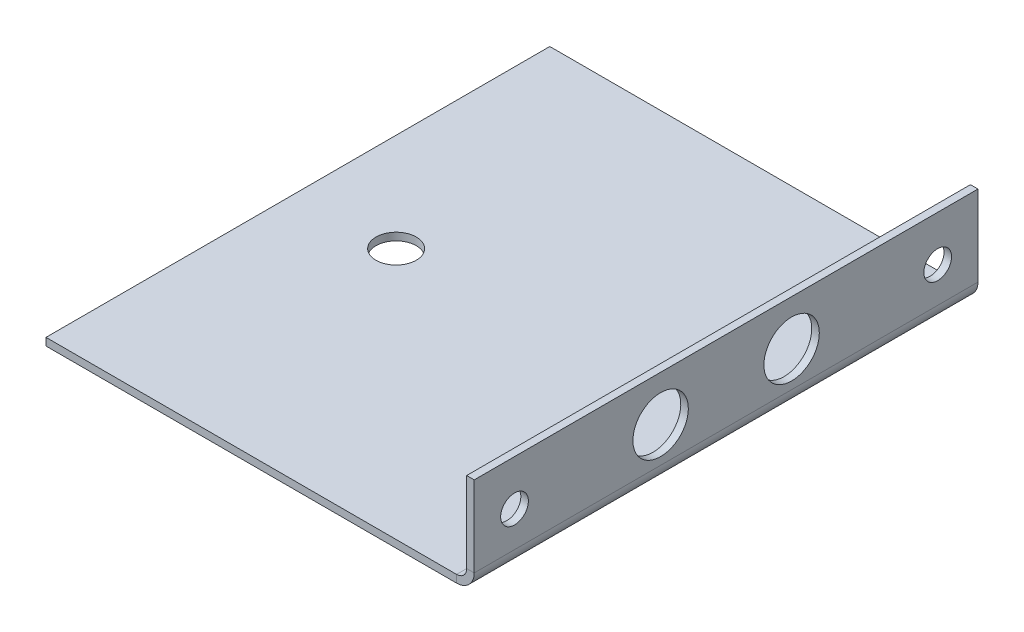
ISO-10303-21;
HEADER;
FILE_DESCRIPTION(('STEP AP214'),'2;1');
FILE_NAME('part.step','',(''),(''),'','','');
FILE_SCHEMA(('AUTOMOTIVE_DESIGN { 1 0 10303 214 1 1 1 1 }'));
ENDSEC;
DATA;
#1=APPLICATION_CONTEXT('core data for automotive mechanical design processes');
#2=APPLICATION_PROTOCOL_DEFINITION('international standard','automotive_design',2000,#1);
#3=PRODUCT_CONTEXT('',#1,'mechanical');
#4=PRODUCT('Part','Part','',(#3));
#5=PRODUCT_RELATED_PRODUCT_CATEGORY('part','',(#4));
#6=PRODUCT_DEFINITION_FORMATION('','',#4);
#7=PRODUCT_DEFINITION_CONTEXT('part definition',#1,'design');
#8=PRODUCT_DEFINITION('design','',#6,#7);
#9=PRODUCT_DEFINITION_SHAPE('','',#8);
#10=(LENGTH_UNIT() NAMED_UNIT(*) SI_UNIT(.MILLI.,.METRE.));
#11=(NAMED_UNIT(*) PLANE_ANGLE_UNIT() SI_UNIT($,.RADIAN.));
#12=(NAMED_UNIT(*) SI_UNIT($,.STERADIAN.) SOLID_ANGLE_UNIT());
#13=UNCERTAINTY_MEASURE_WITH_UNIT(LENGTH_MEASURE(1.E-05),#10,'distance_accuracy_value','');
#14=(GEOMETRIC_REPRESENTATION_CONTEXT(3) GLOBAL_UNCERTAINTY_ASSIGNED_CONTEXT((#13)) GLOBAL_UNIT_ASSIGNED_CONTEXT((#10,
#11,#12)) REPRESENTATION_CONTEXT('',''));
#15=CARTESIAN_POINT('',(0.,0.,0.));
#16=DIRECTION('',(0.,0.,1.));
#17=DIRECTION('',(1.,0.,0.));
#18=AXIS2_PLACEMENT_3D('',#15,#16,#17);
#19=CARTESIAN_POINT('',(-3.5,0.,100.));
#20=DIRECTION('',(0.,0.,1.));
#21=DIRECTION('',(1.,0.,0.));
#22=AXIS2_PLACEMENT_3D('',#19,#20,#21);
#23=PLANE('',#22);
#24=DIRECTION('',(0.,1.,0.));
#25=VECTOR('',#24,1.);
#26=CARTESIAN_POINT('',(-3.5,0.,100.));
#27=LINE('',#26,#25);
#28=CARTESIAN_POINT('',(-3.5,0.,100.));
#29=VERTEX_POINT('',#28);
#30=CARTESIAN_POINT('',(-3.5,1.5,100.));
#31=VERTEX_POINT('',#30);
#32=EDGE_CURVE('E11',#29,#31,#27,.T.);
#33=ORIENTED_EDGE('',*,*,#32,.F.);
#34=CARTESIAN_POINT('',(-3.5,3.5,100.));
#35=DIRECTION('',(0.,0.,1.));
#36=DIRECTION('',(1.,0.,0.));
#37=AXIS2_PLACEMENT_3D('',#34,#35,#36);
#38=CIRCLE('',#37,3.5);
#39=CARTESIAN_POINT('',(0.,3.5,100.));
#40=VERTEX_POINT('',#39);
#41=EDGE_CURVE('E136',#40,#29,#38,.F.);
#42=ORIENTED_EDGE('',*,*,#41,.F.);
#43=DIRECTION('',(1.,0.,0.));
#44=VECTOR('',#43,1.);
#45=CARTESIAN_POINT('',(-1.5,3.5,100.));
#46=LINE('',#45,#44);
#47=CARTESIAN_POINT('',(-1.5,3.5,100.));
#48=VERTEX_POINT('',#47);
#49=EDGE_CURVE('E47',#48,#40,#46,.T.);
#50=ORIENTED_EDGE('',*,*,#49,.F.);
#51=CARTESIAN_POINT('',(-3.5,3.5,100.));
#52=DIRECTION('',(0.,0.,1.));
#53=DIRECTION('',(1.,0.,0.));
#54=AXIS2_PLACEMENT_3D('',#51,#52,#53);
#55=CIRCLE('',#54,2.);
#56=EDGE_CURVE('E129',#48,#31,#55,.F.);
#57=ORIENTED_EDGE('',*,*,#56,.T.);
#58=EDGE_LOOP('',(#33,#42,#50,#57));
#59=FACE_BOUND('',#58,.T.);
#60=ADVANCED_FACE('F38',(#59),#23,.T.);
#61=CARTESIAN_POINT('',(-1.5,3.5,100.));
#62=DIRECTION('',(0.,0.,1.));
#63=DIRECTION('',(1.,0.,0.));
#64=AXIS2_PLACEMENT_3D('',#61,#62,#63);
#65=PLANE('',#64);
#66=DIRECTION('',(-1.,0.,0.));
#67=VECTOR('',#66,1.);
#68=CARTESIAN_POINT('',(0.,0.,100.));
#69=LINE('',#68,#67);
#70=CARTESIAN_POINT('',(-85.,0.,100.));
#71=VERTEX_POINT('',#70);
#72=EDGE_CURVE('E187',#29,#71,#69,.T.);
#73=ORIENTED_EDGE('',*,*,#72,.F.);
#74=ORIENTED_EDGE('',*,*,#32,.T.);
#75=DIRECTION('',(-1.,0.,0.));
#76=VECTOR('',#75,1.);
#77=CARTESIAN_POINT('',(0.,1.5,100.));
#78=LINE('',#77,#76);
#79=CARTESIAN_POINT('',(-85.,1.49999999999999,100.));
#80=VERTEX_POINT('',#79);
#81=EDGE_CURVE('E95',#31,#80,#78,.T.);
#82=ORIENTED_EDGE('',*,*,#81,.T.);
#83=DIRECTION('',(0.,1.,0.));
#84=VECTOR('',#83,1.);
#85=CARTESIAN_POINT('',(-85.,0.,100.));
#86=LINE('',#85,#84);
#87=EDGE_CURVE('E435',#71,#80,#86,.T.);
#88=ORIENTED_EDGE('',*,*,#87,.F.);
#89=EDGE_LOOP('',(#73,#74,#82,#88));
#90=FACE_BOUND('',#89,.T.);
#91=ADVANCED_FACE('F195',(#90),#65,.T.);
#92=CARTESIAN_POINT('',(0.,3.5,0.));
#93=DIRECTION('',(0.,0.,-1.));
#94=DIRECTION('',(-1.,0.,0.));
#95=AXIS2_PLACEMENT_3D('',#92,#93,#94);
#96=PLANE('',#95);
#97=DIRECTION('',(-1.,0.,0.));
#98=VECTOR('',#97,1.);
#99=CARTESIAN_POINT('',(0.,3.5,0.));
#100=LINE('',#99,#98);
#101=CARTESIAN_POINT('',(0.,3.5,0.));
#102=VERTEX_POINT('',#101);
#103=CARTESIAN_POINT('',(-1.5,3.5,0.));
#104=VERTEX_POINT('',#103);
#105=EDGE_CURVE('E82',#102,#104,#100,.T.);
#106=ORIENTED_EDGE('',*,*,#105,.F.);
#107=CARTESIAN_POINT('',(-3.5,3.5,0.));
#108=DIRECTION('',(0.,0.,1.));
#109=DIRECTION('',(1.,0.,0.));
#110=AXIS2_PLACEMENT_3D('',#107,#108,#109);
#111=CIRCLE('',#110,3.5);
#112=CARTESIAN_POINT('',(-3.5,0.,0.));
#113=VERTEX_POINT('',#112);
#114=EDGE_CURVE('E152',#102,#113,#111,.F.);
#115=ORIENTED_EDGE('',*,*,#114,.T.);
#116=DIRECTION('',(0.,-1.,0.));
#117=VECTOR('',#116,1.);
#118=CARTESIAN_POINT('',(-3.5,1.5,0.));
#119=LINE('',#118,#117);
#120=CARTESIAN_POINT('',(-3.5,1.5,0.));
#121=VERTEX_POINT('',#120);
#122=EDGE_CURVE('E89',#121,#113,#119,.T.);
#123=ORIENTED_EDGE('',*,*,#122,.F.);
#124=CARTESIAN_POINT('',(-3.5,3.5,0.));
#125=DIRECTION('',(0.,0.,1.));
#126=DIRECTION('',(1.,0.,0.));
#127=AXIS2_PLACEMENT_3D('',#124,#125,#126);
#128=CIRCLE('',#127,2.);
#129=EDGE_CURVE('E159',#104,#121,#128,.F.);
#130=ORIENTED_EDGE('',*,*,#129,.F.);
#131=EDGE_LOOP('',(#106,#115,#123,#130));
#132=FACE_BOUND('',#131,.T.);
#133=ADVANCED_FACE('F193',(#132),#96,.T.);
#134=CARTESIAN_POINT('',(-3.5,1.5,0.));
#135=DIRECTION('',(0.,0.,-1.));
#136=DIRECTION('',(-1.,0.,0.));
#137=AXIS2_PLACEMENT_3D('',#134,#135,#136);
#138=PLANE('',#137);
#139=DIRECTION('',(0.,-1.,0.));
#140=VECTOR('',#139,1.);
#141=CARTESIAN_POINT('',(0.,19.5,0.));
#142=LINE('',#141,#140);
#143=CARTESIAN_POINT('',(0.,19.5,0.));
#144=VERTEX_POINT('',#143);
#145=EDGE_CURVE('E154',#144,#102,#142,.T.);
#146=ORIENTED_EDGE('',*,*,#145,.T.);
#147=ORIENTED_EDGE('',*,*,#105,.T.);
#148=DIRECTION('',(0.,-1.,0.));
#149=VECTOR('',#148,1.);
#150=CARTESIAN_POINT('',(-1.5,19.5,0.));
#151=LINE('',#150,#149);
#152=CARTESIAN_POINT('',(-1.5,19.5,0.));
#153=VERTEX_POINT('',#152);
#154=EDGE_CURVE('E157',#153,#104,#151,.T.);
#155=ORIENTED_EDGE('',*,*,#154,.F.);
#156=DIRECTION('',(1.,0.,0.));
#157=VECTOR('',#156,1.);
#158=CARTESIAN_POINT('',(-1.5,19.5,0.));
#159=LINE('',#158,#157);
#160=EDGE_CURVE('E117',#153,#144,#159,.T.);
#161=ORIENTED_EDGE('',*,*,#160,.T.);
#162=EDGE_LOOP('',(#146,#147,#155,#161));
#163=FACE_BOUND('',#162,.T.);
#164=ADVANCED_FACE('F189',(#163),#138,.T.);
#165=CARTESIAN_POINT('',(0.,1.5,100.));
#166=DIRECTION('',(0.,-1.,0.));
#167=DIRECTION('',(1.,0.,0.));
#168=AXIS2_PLACEMENT_3D('',#165,#166,#167);
#169=PLANE('',#168);
#170=CARTESIAN_POINT('',(-65.5,1.49999999999999,50.));
#171=DIRECTION('',(0.,1.,0.));
#172=DIRECTION('',(-1.,0.,0.));
#173=AXIS2_PLACEMENT_3D('',#170,#171,#172);
#174=CIRCLE('',#173,4.);
#175=CARTESIAN_POINT('',(-69.5,1.49999999999999,50.));
#176=VERTEX_POINT('',#175);
#177=EDGE_CURVE('E408',#176,#176,#174,.T.);
#178=ORIENTED_EDGE('',*,*,#177,.F.);
#179=EDGE_LOOP('',(#178));
#180=FACE_BOUND('',#179,.T.);
#181=DIRECTION('',(-1.,0.,0.));
#182=VECTOR('',#181,1.);
#183=CARTESIAN_POINT('',(0.,1.5,0.));
#184=LINE('',#183,#182);
#185=CARTESIAN_POINT('',(-85.,1.49999999999999,0.));
#186=VERTEX_POINT('',#185);
#187=EDGE_CURVE('E142',#121,#186,#184,.T.);
#188=ORIENTED_EDGE('',*,*,#187,.T.);
#189=DIRECTION('',(0.,0.,-1.));
#190=VECTOR('',#189,1.);
#191=CARTESIAN_POINT('',(-85.,1.49999999999999,100.));
#192=LINE('',#191,#190);
#193=EDGE_CURVE('E173',#80,#186,#192,.T.);
#194=ORIENTED_EDGE('',*,*,#193,.F.);
#195=ORIENTED_EDGE('',*,*,#81,.F.);
#196=DIRECTION('',(0.,0.,-1.));
#197=VECTOR('',#196,1.);
#198=CARTESIAN_POINT('',(-3.5,1.5,100.));
#199=LINE('',#198,#197);
#200=EDGE_CURVE('E141',#31,#121,#199,.T.);
#201=ORIENTED_EDGE('',*,*,#200,.T.);
#202=EDGE_LOOP('',(#188,#194,#195,#201));
#203=FACE_BOUND('',#202,.T.);
#204=ADVANCED_FACE('F201',(#180,#203),#169,.F.);
#205=CARTESIAN_POINT('',(-85.,0.,100.));
#206=DIRECTION('',(-1.,0.,0.));
#207=DIRECTION('',(0.,0.,1.));
#208=AXIS2_PLACEMENT_3D('',#205,#206,#207);
#209=PLANE('',#208);
#210=DIRECTION('',(0.,1.,0.));
#211=VECTOR('',#210,1.);
#212=CARTESIAN_POINT('',(-85.,0.,0.));
#213=LINE('',#212,#211);
#214=CARTESIAN_POINT('',(-85.,0.,0.));
#215=VERTEX_POINT('',#214);
#216=EDGE_CURVE('E145',#215,#186,#213,.T.);
#217=ORIENTED_EDGE('',*,*,#216,.F.);
#218=DIRECTION('',(0.,0.,-1.));
#219=VECTOR('',#218,1.);
#220=CARTESIAN_POINT('',(-85.,0.,100.));
#221=LINE('',#220,#219);
#222=EDGE_CURVE('E171',#71,#215,#221,.T.);
#223=ORIENTED_EDGE('',*,*,#222,.F.);
#224=ORIENTED_EDGE('',*,*,#87,.T.);
#225=ORIENTED_EDGE('',*,*,#193,.T.);
#226=EDGE_LOOP('',(#217,#223,#224,#225));
#227=FACE_BOUND('',#226,.T.);
#228=ADVANCED_FACE('F230',(#227),#209,.T.);
#229=CARTESIAN_POINT('',(0.,0.,100.));
#230=DIRECTION('',(0.,-1.,0.));
#231=DIRECTION('',(1.,0.,0.));
#232=AXIS2_PLACEMENT_3D('',#229,#230,#231);
#233=PLANE('',#232);
#234=CARTESIAN_POINT('',(-65.5,0.,50.));
#235=DIRECTION('',(0.,-1.,0.));
#236=DIRECTION('',(1.,0.,0.));
#237=AXIS2_PLACEMENT_3D('',#234,#235,#236);
#238=CIRCLE('',#237,4.);
#239=CARTESIAN_POINT('',(-61.5,0.,50.));
#240=VERTEX_POINT('',#239);
#241=EDGE_CURVE('E41',#240,#240,#238,.T.);
#242=ORIENTED_EDGE('',*,*,#241,.F.);
#243=EDGE_LOOP('',(#242));
#244=FACE_BOUND('',#243,.T.);
#245=DIRECTION('',(-1.,0.,0.));
#246=VECTOR('',#245,1.);
#247=CARTESIAN_POINT('',(0.,0.,0.));
#248=LINE('',#247,#246);
#249=EDGE_CURVE('E149',#113,#215,#248,.T.);
#250=ORIENTED_EDGE('',*,*,#249,.F.);
#251=DIRECTION('',(0.,0.,-1.));
#252=VECTOR('',#251,1.);
#253=CARTESIAN_POINT('',(-3.5,0.,100.));
#254=LINE('',#253,#252);
#255=EDGE_CURVE('E168',#29,#113,#254,.T.);
#256=ORIENTED_EDGE('',*,*,#255,.F.);
#257=ORIENTED_EDGE('',*,*,#72,.T.);
#258=ORIENTED_EDGE('',*,*,#222,.T.);
#259=EDGE_LOOP('',(#250,#256,#257,#258));
#260=FACE_BOUND('',#259,.T.);
#261=ADVANCED_FACE('F235',(#244,#260),#233,.T.);
#262=CARTESIAN_POINT('',(-3.5,3.5,100.));
#263=DIRECTION('',(0.,0.,-1.));
#264=DIRECTION('',(-1.,0.,0.));
#265=AXIS2_PLACEMENT_3D('',#262,#263,#264);
#266=CYLINDRICAL_SURFACE('',#265,3.5);
#267=ORIENTED_EDGE('',*,*,#114,.F.);
#268=DIRECTION('',(0.,0.,-1.));
#269=VECTOR('',#268,1.);
#270=CARTESIAN_POINT('',(0.,3.5,100.));
#271=LINE('',#270,#269);
#272=EDGE_CURVE('E165',#40,#102,#271,.T.);
#273=ORIENTED_EDGE('',*,*,#272,.F.);
#274=ORIENTED_EDGE('',*,*,#41,.T.);
#275=ORIENTED_EDGE('',*,*,#255,.T.);
#276=EDGE_LOOP('',(#267,#273,#274,#275));
#277=FACE_BOUND('',#276,.T.);
#278=ADVANCED_FACE('F183',(#277),#266,.T.);
#279=CARTESIAN_POINT('',(0.,19.5,100.));
#280=DIRECTION('',(1.,0.,0.));
#281=DIRECTION('',(0.,1.,0.));
#282=AXIS2_PLACEMENT_3D('',#279,#280,#281);
#283=PLANE('',#282);
#284=CARTESIAN_POINT('',(0.,10.5,8.));
#285=DIRECTION('',(1.,0.,0.));
#286=DIRECTION('',(0.,1.,0.));
#287=AXIS2_PLACEMENT_3D('',#284,#285,#286);
#288=CIRCLE('',#287,2.75);
#289=CARTESIAN_POINT('',(0.,13.25,8.));
#290=VERTEX_POINT('',#289);
#291=EDGE_CURVE('E146',#290,#290,#288,.T.);
#292=ORIENTED_EDGE('',*,*,#291,.F.);
#293=EDGE_LOOP('',(#292));
#294=FACE_BOUND('',#293,.T.);
#295=CARTESIAN_POINT('',(0.,10.5,92.));
#296=DIRECTION('',(1.,0.,0.));
#297=DIRECTION('',(0.,1.,0.));
#298=AXIS2_PLACEMENT_3D('',#295,#296,#297);
#299=CIRCLE('',#298,2.74999999999999);
#300=CARTESIAN_POINT('',(0.,13.25,92.));
#301=VERTEX_POINT('',#300);
#302=EDGE_CURVE('E429',#301,#301,#299,.T.);
#303=ORIENTED_EDGE('',*,*,#302,.F.);
#304=EDGE_LOOP('',(#303));
#305=FACE_BOUND('',#304,.T.);
#306=CARTESIAN_POINT('',(0.,10.5,63.));
#307=DIRECTION('',(1.,0.,0.));
#308=DIRECTION('',(0.,1.,0.));
#309=AXIS2_PLACEMENT_3D('',#306,#307,#308);
#310=CIRCLE('',#309,5.5);
#311=CARTESIAN_POINT('',(0.,16.,63.));
#312=VERTEX_POINT('',#311);
#313=EDGE_CURVE('E426',#312,#312,#310,.T.);
#314=ORIENTED_EDGE('',*,*,#313,.F.);
#315=EDGE_LOOP('',(#314));
#316=FACE_BOUND('',#315,.T.);
#317=CARTESIAN_POINT('',(0.,10.5,37.));
#318=DIRECTION('',(1.,0.,0.));
#319=DIRECTION('',(0.,1.,0.));
#320=AXIS2_PLACEMENT_3D('',#317,#318,#319);
#321=CIRCLE('',#320,5.5);
#322=CARTESIAN_POINT('',(0.,16.,37.));
#323=VERTEX_POINT('',#322);
#324=EDGE_CURVE('E423',#323,#323,#321,.T.);
#325=ORIENTED_EDGE('',*,*,#324,.F.);
#326=EDGE_LOOP('',(#325));
#327=FACE_BOUND('',#326,.T.);
#328=ORIENTED_EDGE('',*,*,#145,.F.);
#329=DIRECTION('',(0.,0.,-1.));
#330=VECTOR('',#329,1.);
#331=CARTESIAN_POINT('',(0.,19.5,100.));
#332=LINE('',#331,#330);
#333=CARTESIAN_POINT('',(0.,19.5,100.));
#334=VERTEX_POINT('',#333);
#335=EDGE_CURVE('E119',#334,#144,#332,.T.);
#336=ORIENTED_EDGE('',*,*,#335,.F.);
#337=DIRECTION('',(0.,-1.,0.));
#338=VECTOR('',#337,1.);
#339=CARTESIAN_POINT('',(0.,19.5,100.));
#340=LINE('',#339,#338);
#341=EDGE_CURVE('E134',#334,#40,#340,.T.);
#342=ORIENTED_EDGE('',*,*,#341,.T.);
#343=ORIENTED_EDGE('',*,*,#272,.T.);
#344=EDGE_LOOP('',(#328,#336,#342,#343));
#345=FACE_BOUND('',#344,.T.);
#346=ADVANCED_FACE('F188',(#294,#305,#316,#327,#345),#283,.T.);
#347=CARTESIAN_POINT('',(-1.5,19.5,100.));
#348=DIRECTION('',(0.,1.,0.));
#349=DIRECTION('',(0.,0.,1.));
#350=AXIS2_PLACEMENT_3D('',#347,#348,#349);
#351=PLANE('',#350);
#352=ORIENTED_EDGE('',*,*,#160,.F.);
#353=DIRECTION('',(0.,0.,-1.));
#354=VECTOR('',#353,1.);
#355=CARTESIAN_POINT('',(-1.5,19.5,100.));
#356=LINE('',#355,#354);
#357=CARTESIAN_POINT('',(-1.5,19.5,100.));
#358=VERTEX_POINT('',#357);
#359=EDGE_CURVE('E111',#358,#153,#356,.T.);
#360=ORIENTED_EDGE('',*,*,#359,.F.);
#361=DIRECTION('',(1.,0.,0.));
#362=VECTOR('',#361,1.);
#363=CARTESIAN_POINT('',(-1.5,19.5,100.));
#364=LINE('',#363,#362);
#365=EDGE_CURVE('E115',#358,#334,#364,.T.);
#366=ORIENTED_EDGE('',*,*,#365,.T.);
#367=ORIENTED_EDGE('',*,*,#335,.T.);
#368=EDGE_LOOP('',(#352,#360,#366,#367));
#369=FACE_BOUND('',#368,.T.);
#370=ADVANCED_FACE('F113',(#369),#351,.T.);
#371=CARTESIAN_POINT('',(-1.5,19.5,100.));
#372=DIRECTION('',(1.,0.,0.));
#373=DIRECTION('',(0.,1.,0.));
#374=AXIS2_PLACEMENT_3D('',#371,#372,#373);
#375=PLANE('',#374);
#376=CARTESIAN_POINT('',(-1.5,10.5,8.));
#377=DIRECTION('',(-1.,0.,0.));
#378=DIRECTION('',(0.,-1.,0.));
#379=AXIS2_PLACEMENT_3D('',#376,#377,#378);
#380=CIRCLE('',#379,2.75);
#381=CARTESIAN_POINT('',(-1.5,7.75000000000001,8.));
#382=VERTEX_POINT('',#381);
#383=EDGE_CURVE('E415',#382,#382,#380,.T.);
#384=ORIENTED_EDGE('',*,*,#383,.F.);
#385=EDGE_LOOP('',(#384));
#386=FACE_BOUND('',#385,.T.);
#387=CARTESIAN_POINT('',(-1.5,10.5,92.));
#388=DIRECTION('',(-1.,0.,0.));
#389=DIRECTION('',(0.,1.,0.));
#390=AXIS2_PLACEMENT_3D('',#387,#388,#389);
#391=CIRCLE('',#390,2.74999999999999);
#392=CARTESIAN_POINT('',(-1.5,13.25,92.));
#393=VERTEX_POINT('',#392);
#394=EDGE_CURVE('E414',#393,#393,#391,.T.);
#395=ORIENTED_EDGE('',*,*,#394,.F.);
#396=EDGE_LOOP('',(#395));
#397=FACE_BOUND('',#396,.T.);
#398=CARTESIAN_POINT('',(-1.5,10.5,63.));
#399=DIRECTION('',(-1.,0.,0.));
#400=DIRECTION('',(0.,1.,0.));
#401=AXIS2_PLACEMENT_3D('',#398,#399,#400);
#402=CIRCLE('',#401,5.5);
#403=CARTESIAN_POINT('',(-1.5,16.,63.));
#404=VERTEX_POINT('',#403);
#405=EDGE_CURVE('E410',#404,#404,#402,.T.);
#406=ORIENTED_EDGE('',*,*,#405,.F.);
#407=EDGE_LOOP('',(#406));
#408=FACE_BOUND('',#407,.T.);
#409=CARTESIAN_POINT('',(-1.5,10.5,37.));
#410=DIRECTION('',(-1.,0.,0.));
#411=DIRECTION('',(0.,-1.,0.));
#412=AXIS2_PLACEMENT_3D('',#409,#410,#411);
#413=CIRCLE('',#412,5.5);
#414=CARTESIAN_POINT('',(-1.5,5.00000000000001,37.));
#415=VERTEX_POINT('',#414);
#416=EDGE_CURVE('E418',#415,#415,#413,.T.);
#417=ORIENTED_EDGE('',*,*,#416,.F.);
#418=EDGE_LOOP('',(#417));
#419=FACE_BOUND('',#418,.T.);
#420=ORIENTED_EDGE('',*,*,#154,.T.);
#421=DIRECTION('',(0.,0.,-1.));
#422=VECTOR('',#421,1.);
#423=CARTESIAN_POINT('',(-1.5,3.5,100.));
#424=LINE('',#423,#422);
#425=EDGE_CURVE('E120',#48,#104,#424,.T.);
#426=ORIENTED_EDGE('',*,*,#425,.F.);
#427=DIRECTION('',(0.,-1.,0.));
#428=VECTOR('',#427,1.);
#429=CARTESIAN_POINT('',(-1.5,19.5,100.));
#430=LINE('',#429,#428);
#431=EDGE_CURVE('E124',#358,#48,#430,.T.);
#432=ORIENTED_EDGE('',*,*,#431,.F.);
#433=ORIENTED_EDGE('',*,*,#359,.T.);
#434=EDGE_LOOP('',(#420,#426,#432,#433));
#435=FACE_BOUND('',#434,.T.);
#436=ADVANCED_FACE('F125',(#386,#397,#408,#419,#435),#375,.F.);
#437=CARTESIAN_POINT('',(-3.5,3.5,100.));
#438=DIRECTION('',(0.,0.,-1.));
#439=DIRECTION('',(-1.,0.,0.));
#440=AXIS2_PLACEMENT_3D('',#437,#438,#439);
#441=CYLINDRICAL_SURFACE('',#440,2.);
#442=ORIENTED_EDGE('',*,*,#129,.T.);
#443=ORIENTED_EDGE('',*,*,#200,.F.);
#444=ORIENTED_EDGE('',*,*,#56,.F.);
#445=ORIENTED_EDGE('',*,*,#425,.T.);
#446=EDGE_LOOP('',(#442,#443,#444,#445));
#447=FACE_BOUND('',#446,.T.);
#448=ADVANCED_FACE('F191',(#447),#441,.F.);
#449=CARTESIAN_POINT('',(-3.5,3.5,100.));
#450=DIRECTION('',(0.,0.,1.));
#451=DIRECTION('',(1.,0.,0.));
#452=AXIS2_PLACEMENT_3D('',#449,#450,#451);
#453=PLANE('',#452);
#454=ORIENTED_EDGE('',*,*,#431,.T.);
#455=ORIENTED_EDGE('',*,*,#49,.T.);
#456=ORIENTED_EDGE('',*,*,#341,.F.);
#457=ORIENTED_EDGE('',*,*,#365,.F.);
#458=EDGE_LOOP('',(#454,#455,#456,#457));
#459=FACE_BOUND('',#458,.T.);
#460=ADVANCED_FACE('F132',(#459),#453,.T.);
#461=CARTESIAN_POINT('',(-3.5,3.5,0.));
#462=DIRECTION('',(0.,0.,1.));
#463=DIRECTION('',(1.,0.,0.));
#464=AXIS2_PLACEMENT_3D('',#461,#462,#463);
#465=PLANE('',#464);
#466=ORIENTED_EDGE('',*,*,#187,.F.);
#467=ORIENTED_EDGE('',*,*,#122,.T.);
#468=ORIENTED_EDGE('',*,*,#249,.T.);
#469=ORIENTED_EDGE('',*,*,#216,.T.);
#470=EDGE_LOOP('',(#466,#467,#468,#469));
#471=FACE_BOUND('',#470,.T.);
#472=ADVANCED_FACE('F279',(#471),#465,.F.);
#473=CARTESIAN_POINT('',(8.5,10.5,37.));
#474=DIRECTION('',(-1.,0.,0.));
#475=DIRECTION('',(0.,-1.,0.));
#476=AXIS2_PLACEMENT_3D('',#473,#474,#475);
#477=CYLINDRICAL_SURFACE('',#476,5.5);
#478=ORIENTED_EDGE('',*,*,#324,.T.);
#479=EDGE_LOOP('',(#478));
#480=FACE_BOUND('',#479,.T.);
#481=ORIENTED_EDGE('',*,*,#416,.T.);
#482=EDGE_LOOP('',(#481));
#483=FACE_BOUND('',#482,.T.);
#484=ADVANCED_FACE('F289',(#480,#483),#477,.F.);
#485=CARTESIAN_POINT('',(8.5,10.5,63.));
#486=DIRECTION('',(-1.,0.,0.));
#487=DIRECTION('',(0.,-1.,0.));
#488=AXIS2_PLACEMENT_3D('',#485,#486,#487);
#489=CYLINDRICAL_SURFACE('',#488,5.5);
#490=ORIENTED_EDGE('',*,*,#313,.T.);
#491=EDGE_LOOP('',(#490));
#492=FACE_BOUND('',#491,.T.);
#493=ORIENTED_EDGE('',*,*,#405,.T.);
#494=EDGE_LOOP('',(#493));
#495=FACE_BOUND('',#494,.T.);
#496=ADVANCED_FACE('F316',(#492,#495),#489,.F.);
#497=CARTESIAN_POINT('',(8.5,10.5,92.));
#498=DIRECTION('',(-1.,0.,0.));
#499=DIRECTION('',(0.,-1.,0.));
#500=AXIS2_PLACEMENT_3D('',#497,#498,#499);
#501=CYLINDRICAL_SURFACE('',#500,2.74999999999999);
#502=ORIENTED_EDGE('',*,*,#302,.T.);
#503=EDGE_LOOP('',(#502));
#504=FACE_BOUND('',#503,.T.);
#505=ORIENTED_EDGE('',*,*,#394,.T.);
#506=EDGE_LOOP('',(#505));
#507=FACE_BOUND('',#506,.T.);
#508=ADVANCED_FACE('F327',(#504,#507),#501,.F.);
#509=CARTESIAN_POINT('',(8.5,10.5,8.));
#510=DIRECTION('',(-1.,0.,0.));
#511=DIRECTION('',(0.,-1.,0.));
#512=AXIS2_PLACEMENT_3D('',#509,#510,#511);
#513=CYLINDRICAL_SURFACE('',#512,2.75);
#514=ORIENTED_EDGE('',*,*,#291,.T.);
#515=EDGE_LOOP('',(#514));
#516=FACE_BOUND('',#515,.T.);
#517=ORIENTED_EDGE('',*,*,#383,.T.);
#518=EDGE_LOOP('',(#517));
#519=FACE_BOUND('',#518,.T.);
#520=ADVANCED_FACE('F338',(#516,#519),#513,.F.);
#521=CARTESIAN_POINT('',(-65.5,-8.50000000000001,50.));
#522=DIRECTION('',(0.,1.,0.));
#523=DIRECTION('',(-1.,0.,0.));
#524=AXIS2_PLACEMENT_3D('',#521,#522,#523);
#525=CYLINDRICAL_SURFACE('',#524,4.);
#526=ORIENTED_EDGE('',*,*,#241,.T.);
#527=EDGE_LOOP('',(#526));
#528=FACE_BOUND('',#527,.T.);
#529=ORIENTED_EDGE('',*,*,#177,.T.);
#530=EDGE_LOOP('',(#529));
#531=FACE_BOUND('',#530,.T.);
#532=ADVANCED_FACE('F349',(#528,#531),#525,.F.);
#533=CLOSED_SHELL('',(#60,#91,#133,#164,#204,#228,#261,#278,#346,#370,#436,#448,#460,#472,#484,
#496,#508,#520,#532));
#534=MANIFOLD_SOLID_BREP('B2',#533);
#535=ADVANCED_BREP_SHAPE_REPRESENTATION('',(#18,#534),#14);
#536=SHAPE_DEFINITION_REPRESENTATION(#9,#535);
ENDSEC;
END-ISO-10303-21;
